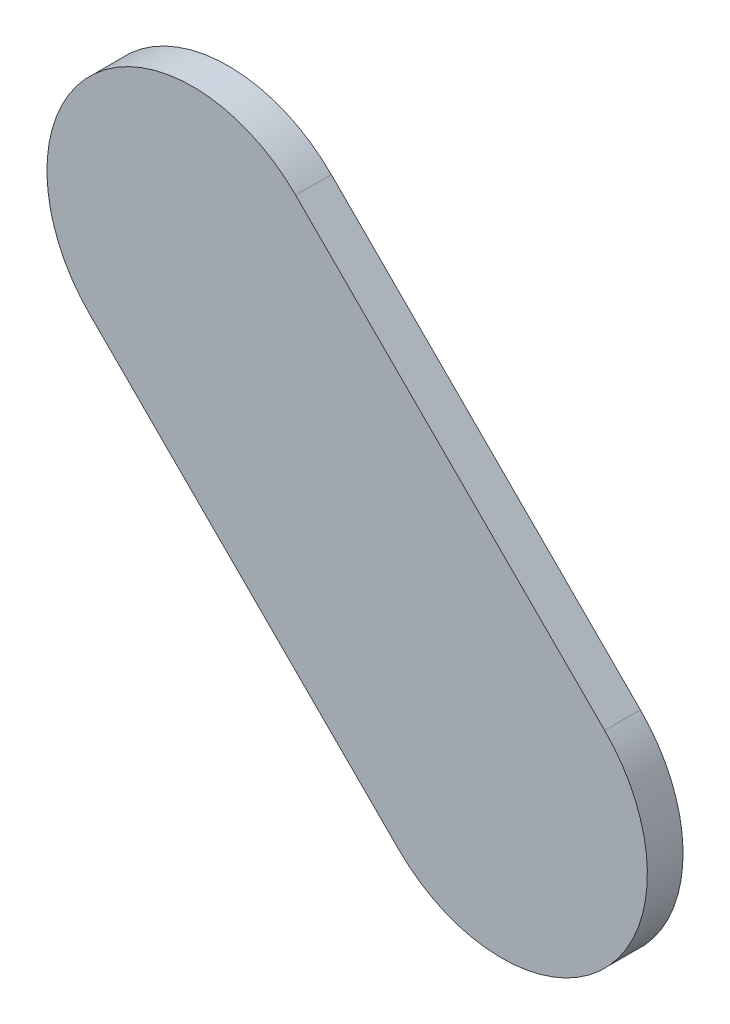
ISO-10303-21;
HEADER;
FILE_DESCRIPTION(('STEP AP214'),'2;1');
FILE_NAME('part.step','',(''),(''),'','','');
FILE_SCHEMA(('AUTOMOTIVE_DESIGN { 1 0 10303 214 1 1 1 1 }'));
ENDSEC;
DATA;
#1=APPLICATION_CONTEXT('core data for automotive mechanical design processes');
#2=APPLICATION_PROTOCOL_DEFINITION('international standard','automotive_design',2000,#1);
#3=PRODUCT_CONTEXT('',#1,'mechanical');
#4=PRODUCT('Part','Part','',(#3));
#5=PRODUCT_RELATED_PRODUCT_CATEGORY('part','',(#4));
#6=PRODUCT_DEFINITION_FORMATION('','',#4);
#7=PRODUCT_DEFINITION_CONTEXT('part definition',#1,'design');
#8=PRODUCT_DEFINITION('design','',#6,#7);
#9=PRODUCT_DEFINITION_SHAPE('','',#8);
#10=(LENGTH_UNIT() NAMED_UNIT(*) SI_UNIT(.MILLI.,.METRE.));
#11=(NAMED_UNIT(*) PLANE_ANGLE_UNIT() SI_UNIT($,.RADIAN.));
#12=(NAMED_UNIT(*) SI_UNIT($,.STERADIAN.) SOLID_ANGLE_UNIT());
#13=UNCERTAINTY_MEASURE_WITH_UNIT(LENGTH_MEASURE(1.E-05),#10,'distance_accuracy_value','');
#14=(GEOMETRIC_REPRESENTATION_CONTEXT(3) GLOBAL_UNCERTAINTY_ASSIGNED_CONTEXT((#13)) GLOBAL_UNIT_ASSIGNED_CONTEXT((#10,
#11,#12)) REPRESENTATION_CONTEXT('',''));
#15=CARTESIAN_POINT('',(0.,0.,0.));
#16=DIRECTION('',(0.,0.,1.));
#17=DIRECTION('',(1.,0.,0.));
#18=AXIS2_PLACEMENT_3D('',#15,#16,#17);
#19=CARTESIAN_POINT('',(6.130091666303,2.446000705288,0.76487));
#20=DIRECTION('',(0.,0.,-1.));
#21=DIRECTION('',(-1.,0.,0.));
#22=AXIS2_PLACEMENT_3D('',#19,#20,#21);
#23=PLANE('',#22);
#24=DIRECTION('',(0.707105987136602,-0.707107575235602,0.));
#25=VECTOR('',#24,1.);
#26=CARTESIAN_POINT('',(6.080701000001,2.692862333,0.76487));
#27=LINE('',#26,#25);
#28=CARTESIAN_POINT('',(6.08070103026742,2.69286230273362,0.76487));
#29=VERTEX_POINT('',#28);
#30=CARTESIAN_POINT('',(6.37768555533316,2.39587711066617,0.76487));
#31=VERTEX_POINT('',#30);
#32=EDGE_CURVE('E54',#29,#31,#27,.T.);
#33=ORIENTED_EDGE('',*,*,#32,.T.);
#34=CARTESIAN_POINT('',(6.278690667,2.296882,0.76487));
#35=DIRECTION('',(0.,0.,1.));
#36=DIRECTION('',(1.,0.,0.));
#37=AXIS2_PLACEMENT_3D('',#34,#35,#36);
#38=CIRCLE('',#37,0.140000070901);
#39=CARTESIAN_POINT('',(6.17969574790159,2.19788758610059,0.76487));
#40=VERTEX_POINT('',#39);
#41=EDGE_CURVE('E20',#40,#31,#38,.T.);
#42=ORIENTED_EDGE('',*,*,#41,.F.);
#43=DIRECTION('',(-0.707107575236102,0.707105987136102,0.));
#44=VECTOR('',#43,1.);
#45=CARTESIAN_POINT('',(6.179695667001,2.197887667001,0.76487));
#46=LINE('',#45,#44);
#47=CARTESIAN_POINT('',(5.88271055583361,2.49487211116655,0.76487));
#48=VERTEX_POINT('',#47);
#49=EDGE_CURVE('E78',#40,#48,#46,.T.);
#50=ORIENTED_EDGE('',*,*,#49,.T.);
#51=CARTESIAN_POINT('',(5.981705333,2.593867333,0.76487));
#52=DIRECTION('',(0.,0.,1.));
#53=DIRECTION('',(1.,0.,0.));
#54=AXIS2_PLACEMENT_3D('',#51,#52,#53);
#55=CIRCLE('',#54,0.140000070901);
#56=EDGE_CURVE('E58',#29,#48,#55,.T.);
#57=ORIENTED_EDGE('',*,*,#56,.F.);
#58=EDGE_LOOP('',(#33,#42,#50,#57));
#59=FACE_BOUND('',#58,.T.);
#60=ADVANCED_FACE('F17',(#59),#23,.T.);
#61=CARTESIAN_POINT('',(6.278690667,2.296882,0.76487));
#62=DIRECTION('',(0.,0.,1.));
#63=DIRECTION('',(1.,0.,0.));
#64=AXIS2_PLACEMENT_3D('',#61,#62,#63);
#65=CYLINDRICAL_SURFACE('',#64,0.140000070901);
#66=ORIENTED_EDGE('',*,*,#41,.T.);
#67=DIRECTION('',(0.,0.,1.));
#68=VECTOR('',#67,1.);
#69=CARTESIAN_POINT('',(6.37768533299991,2.39587733299991,0.76487));
#70=LINE('',#69,#68);
#71=CARTESIAN_POINT('',(6.37768555533321,2.39587711066625,0.79916));
#72=VERTEX_POINT('',#71);
#73=EDGE_CURVE('E62',#31,#72,#70,.T.);
#74=ORIENTED_EDGE('',*,*,#73,.T.);
#75=CARTESIAN_POINT('',(6.278690667001,2.296882565733,0.79916));
#76=DIRECTION('',(0.,0.,1.));
#77=DIRECTION('',(1.,0.,0.));
#78=AXIS2_PLACEMENT_3D('',#75,#76,#77);
#79=CIRCLE('',#78,0.14);
#80=CARTESIAN_POINT('',(6.17969574790162,2.19788758610056,0.79916));
#81=VERTEX_POINT('',#80);
#82=EDGE_CURVE('E82',#81,#72,#79,.T.);
#83=ORIENTED_EDGE('',*,*,#82,.F.);
#84=DIRECTION('',(0.,0.,1.));
#85=VECTOR('',#84,1.);
#86=CARTESIAN_POINT('',(6.179695667001,2.197887667001,0.76487));
#87=LINE('',#86,#85);
#88=EDGE_CURVE('E69',#81,#40,#87,.F.);
#89=ORIENTED_EDGE('',*,*,#88,.T.);
#90=EDGE_LOOP('',(#66,#74,#83,#89));
#91=FACE_BOUND('',#90,.T.);
#92=ADVANCED_FACE('F66',(#91),#65,.T.);
#93=CARTESIAN_POINT('',(6.080701000001,2.692862333,0.76487));
#94=DIRECTION('',(-0.707107575235602,-0.707105987136602,0.));
#95=DIRECTION('',(0.707105987136602,-0.707107575235602,0.));
#96=AXIS2_PLACEMENT_3D('',#93,#94,#95);
#97=PLANE('',#96);
#98=ORIENTED_EDGE('',*,*,#73,.F.);
#99=ORIENTED_EDGE('',*,*,#32,.F.);
#100=DIRECTION('',(0.,0.,1.));
#101=VECTOR('',#100,1.);
#102=CARTESIAN_POINT('',(6.08070100000123,2.69286233300023,0.76487));
#103=LINE('',#102,#101);
#104=CARTESIAN_POINT('',(6.08070103026741,2.69286230273364,0.79916));
#105=VERTEX_POINT('',#104);
#106=EDGE_CURVE('E73',#105,#29,#103,.F.);
#107=ORIENTED_EDGE('',*,*,#106,.F.);
#108=DIRECTION('',(-0.707105987136807,0.707107575235396,0.));
#109=VECTOR('',#108,1.);
#110=CARTESIAN_POINT('',(6.377685333,2.395877333,0.79916));
#111=LINE('',#110,#109);
#112=EDGE_CURVE('E72',#72,#105,#111,.T.);
#113=ORIENTED_EDGE('',*,*,#112,.F.);
#114=EDGE_LOOP('',(#98,#99,#107,#113));
#115=FACE_BOUND('',#114,.T.);
#116=ADVANCED_FACE('F71',(#115),#97,.F.);
#117=CARTESIAN_POINT('',(5.981705333,2.593867333,0.76487));
#118=DIRECTION('',(0.,0.,1.));
#119=DIRECTION('',(1.,0.,0.));
#120=AXIS2_PLACEMENT_3D('',#117,#118,#119);
#121=CYLINDRICAL_SURFACE('',#120,0.140000070901);
#122=ORIENTED_EDGE('',*,*,#56,.T.);
#123=DIRECTION('',(0.,0.,1.));
#124=VECTOR('',#123,1.);
#125=CARTESIAN_POINT('',(5.8827106670002,2.4948720000002,0.76487));
#126=LINE('',#125,#124);
#127=CARTESIAN_POINT('',(5.88271055583349,2.49487211116636,0.79916));
#128=VERTEX_POINT('',#127);
#129=EDGE_CURVE('E79',#48,#128,#126,.T.);
#130=ORIENTED_EDGE('',*,*,#129,.T.);
#131=CARTESIAN_POINT('',(5.981705667,2.593867101268,0.79916));
#132=DIRECTION('',(0.,0.,1.));
#133=DIRECTION('',(1.,0.,0.));
#134=AXIS2_PLACEMENT_3D('',#131,#132,#133);
#135=CIRCLE('',#134,0.140000470934);
#136=EDGE_CURVE('E26',#105,#128,#135,.T.);
#137=ORIENTED_EDGE('',*,*,#136,.F.);
#138=ORIENTED_EDGE('',*,*,#106,.T.);
#139=EDGE_LOOP('',(#122,#130,#137,#138));
#140=FACE_BOUND('',#139,.T.);
#141=ADVANCED_FACE('F91',(#140),#121,.T.);
#142=CARTESIAN_POINT('',(6.179695667001,2.197887667001,0.76487));
#143=DIRECTION('',(0.707105987136102,0.707107575236102,0.));
#144=DIRECTION('',(-0.707107575236102,0.707105987136102,0.));
#145=AXIS2_PLACEMENT_3D('',#142,#143,#144);
#146=PLANE('',#145);
#147=ORIENTED_EDGE('',*,*,#129,.F.);
#148=ORIENTED_EDGE('',*,*,#49,.F.);
#149=ORIENTED_EDGE('',*,*,#88,.F.);
#150=DIRECTION('',(0.707107575236588,-0.707105987135616,0.));
#151=VECTOR('',#150,1.);
#152=CARTESIAN_POINT('',(5.882710667,2.494872,0.79916));
#153=LINE('',#152,#151);
#154=EDGE_CURVE('E11',#128,#81,#153,.T.);
#155=ORIENTED_EDGE('',*,*,#154,.F.);
#156=EDGE_LOOP('',(#147,#148,#149,#155));
#157=FACE_BOUND('',#156,.T.);
#158=ADVANCED_FACE('F90',(#157),#146,.F.);
#159=CARTESIAN_POINT('',(6.130091666303,2.446000705288,0.79916));
#160=DIRECTION('',(0.,0.,1.));
#161=DIRECTION('',(1.,0.,0.));
#162=AXIS2_PLACEMENT_3D('',#159,#160,#161);
#163=PLANE('',#162);
#164=ORIENTED_EDGE('',*,*,#136,.T.);
#165=ORIENTED_EDGE('',*,*,#154,.T.);
#166=ORIENTED_EDGE('',*,*,#82,.T.);
#167=ORIENTED_EDGE('',*,*,#112,.T.);
#168=EDGE_LOOP('',(#164,#165,#166,#167));
#169=FACE_BOUND('',#168,.T.);
#170=ADVANCED_FACE('F87',(#169),#163,.T.);
#171=CLOSED_SHELL('',(#60,#92,#116,#141,#158,#170));
#172=MANIFOLD_SOLID_BREP('B1',#171);
#173=ADVANCED_BREP_SHAPE_REPRESENTATION('',(#18,#172),#14);
#174=SHAPE_DEFINITION_REPRESENTATION(#9,#173);
ENDSEC;
END-ISO-10303-21;
